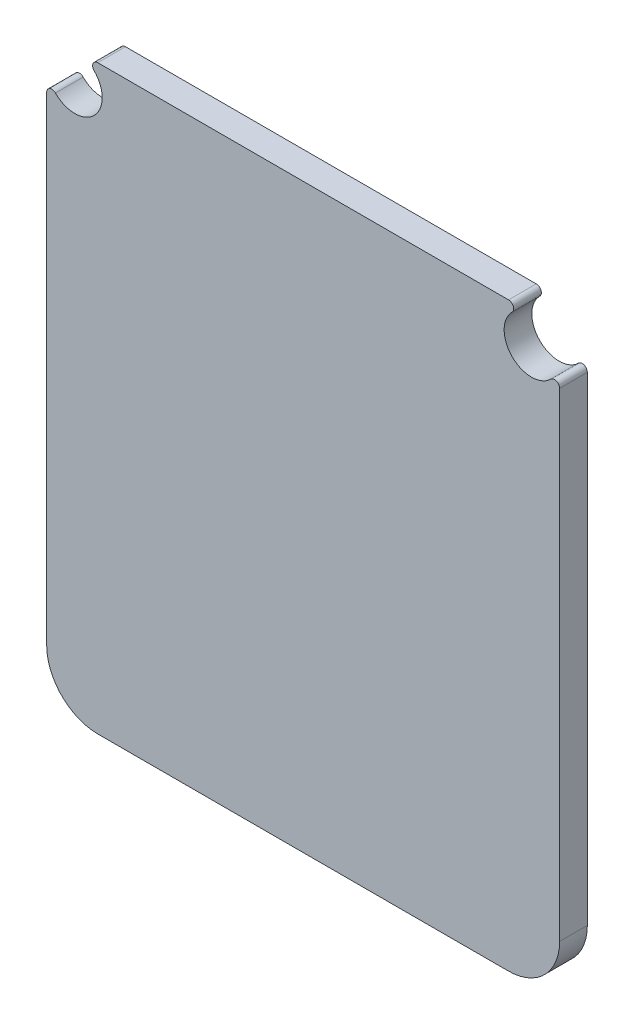
ISO-10303-21;
HEADER;
FILE_DESCRIPTION(('STEP AP214'),'2;1');
FILE_NAME('part.step','',(''),(''),'','','');
FILE_SCHEMA(('AUTOMOTIVE_DESIGN { 1 0 10303 214 1 1 1 1 }'));
ENDSEC;
DATA;
#1=APPLICATION_CONTEXT('core data for automotive mechanical design processes');
#2=APPLICATION_PROTOCOL_DEFINITION('international standard','automotive_design',2000,#1);
#3=PRODUCT_CONTEXT('',#1,'mechanical');
#4=PRODUCT('Part','Part','',(#3));
#5=PRODUCT_RELATED_PRODUCT_CATEGORY('part','',(#4));
#6=PRODUCT_DEFINITION_FORMATION('','',#4);
#7=PRODUCT_DEFINITION_CONTEXT('part definition',#1,'design');
#8=PRODUCT_DEFINITION('design','',#6,#7);
#9=PRODUCT_DEFINITION_SHAPE('','',#8);
#10=(LENGTH_UNIT() NAMED_UNIT(*) SI_UNIT(.MILLI.,.METRE.));
#11=(NAMED_UNIT(*) PLANE_ANGLE_UNIT() SI_UNIT($,.RADIAN.));
#12=(NAMED_UNIT(*) SI_UNIT($,.STERADIAN.) SOLID_ANGLE_UNIT());
#13=UNCERTAINTY_MEASURE_WITH_UNIT(LENGTH_MEASURE(1.E-05),#10,'distance_accuracy_value','');
#14=(GEOMETRIC_REPRESENTATION_CONTEXT(3) GLOBAL_UNCERTAINTY_ASSIGNED_CONTEXT((#13)) GLOBAL_UNIT_ASSIGNED_CONTEXT((#10,
#11,#12)) REPRESENTATION_CONTEXT('',''));
#15=CARTESIAN_POINT('',(0.,0.,0.));
#16=DIRECTION('',(0.,0.,1.));
#17=DIRECTION('',(1.,0.,0.));
#18=AXIS2_PLACEMENT_3D('',#15,#16,#17);
#19=CARTESIAN_POINT('',(13.,29.,1.6194));
#20=DIRECTION('',(0.,0.,-1.));
#21=DIRECTION('',(-1.,0.,0.));
#22=AXIS2_PLACEMENT_3D('',#19,#20,#21);
#23=CYLINDRICAL_SURFACE('',#22,3.);
#24=CARTESIAN_POINT('',(13.,29.,0.));
#25=DIRECTION('',(0.,0.,1.));
#26=DIRECTION('',(-1.,0.,0.));
#27=AXIS2_PLACEMENT_3D('',#24,#25,#26);
#28=CIRCLE('',#27,3.);
#29=CARTESIAN_POINT('',(10.,29.,0.));
#30=VERTEX_POINT('',#29);
#31=CARTESIAN_POINT('',(13.,26.,0.));
#32=VERTEX_POINT('',#31);
#33=EDGE_CURVE('E158',#30,#32,#28,.T.);
#34=ORIENTED_EDGE('',*,*,#33,.T.);
#35=DIRECTION('',(0.,0.,-1.));
#36=VECTOR('',#35,1.);
#37=CARTESIAN_POINT('',(13.,26.,1.6194));
#38=LINE('',#37,#36);
#39=CARTESIAN_POINT('',(13.,26.,1.6194));
#40=VERTEX_POINT('',#39);
#41=EDGE_CURVE('E11',#40,#32,#38,.T.);
#42=ORIENTED_EDGE('',*,*,#41,.F.);
#43=CARTESIAN_POINT('',(13.,29.,1.6194));
#44=DIRECTION('',(0.,0.,1.));
#45=DIRECTION('',(-1.,0.,0.));
#46=AXIS2_PLACEMENT_3D('',#43,#44,#45);
#47=CIRCLE('',#46,3.);
#48=CARTESIAN_POINT('',(10.,29.,1.6194));
#49=VERTEX_POINT('',#48);
#50=EDGE_CURVE('E180',#49,#40,#47,.T.);
#51=ORIENTED_EDGE('',*,*,#50,.F.);
#52=DIRECTION('',(0.,0.,-1.));
#53=VECTOR('',#52,1.);
#54=CARTESIAN_POINT('',(10.,29.,1.6194));
#55=LINE('',#54,#53);
#56=EDGE_CURVE('E154',#49,#30,#55,.T.);
#57=ORIENTED_EDGE('',*,*,#56,.T.);
#58=EDGE_LOOP('',(#34,#42,#51,#57));
#59=FACE_BOUND('',#58,.T.);
#60=ADVANCED_FACE('F38',(#59),#23,.T.);
#61=CARTESIAN_POINT('',(37.,26.,1.6194));
#62=DIRECTION('',(0.,1.,0.));
#63=DIRECTION('',(0.,0.,1.));
#64=AXIS2_PLACEMENT_3D('',#61,#62,#63);
#65=PLANE('',#64);
#66=DIRECTION('',(1.,0.,0.));
#67=VECTOR('',#66,1.);
#68=CARTESIAN_POINT('',(37.,26.,0.));
#69=LINE('',#68,#67);
#70=CARTESIAN_POINT('',(37.,26.,0.));
#71=VERTEX_POINT('',#70);
#72=EDGE_CURVE('E161',#32,#71,#69,.T.);
#73=ORIENTED_EDGE('',*,*,#72,.T.);
#74=DIRECTION('',(0.,0.,-1.));
#75=VECTOR('',#74,1.);
#76=CARTESIAN_POINT('',(37.,26.,1.6194));
#77=LINE('',#76,#75);
#78=CARTESIAN_POINT('',(37.,26.,1.6194));
#79=VERTEX_POINT('',#78);
#80=EDGE_CURVE('E46',#79,#71,#77,.T.);
#81=ORIENTED_EDGE('',*,*,#80,.F.);
#82=DIRECTION('',(1.,0.,0.));
#83=VECTOR('',#82,1.);
#84=CARTESIAN_POINT('',(37.,26.,1.6194));
#85=LINE('',#84,#83);
#86=EDGE_CURVE('E109',#40,#79,#85,.T.);
#87=ORIENTED_EDGE('',*,*,#86,.F.);
#88=ORIENTED_EDGE('',*,*,#41,.T.);
#89=EDGE_LOOP('',(#73,#81,#87,#88));
#90=FACE_BOUND('',#89,.T.);
#91=ADVANCED_FACE('F258',(#90),#65,.F.);
#92=CARTESIAN_POINT('',(37.0000100000167,28.9999899999833,1.6194));
#93=DIRECTION('',(0.,0.,-1.));
#94=DIRECTION('',(-1.,0.,0.));
#95=AXIS2_PLACEMENT_3D('',#92,#93,#94);
#96=CYLINDRICAL_SURFACE('',#95,2.99999);
#97=CARTESIAN_POINT('',(37.0000100000167,28.9999899999833,0.));
#98=DIRECTION('',(0.,0.,1.));
#99=DIRECTION('',(-1.,0.,0.));
#100=AXIS2_PLACEMENT_3D('',#97,#98,#99);
#101=CIRCLE('',#100,2.99999);
#102=CARTESIAN_POINT('',(40.,29.,0.));
#103=VERTEX_POINT('',#102);
#104=EDGE_CURVE('E163',#71,#103,#101,.T.);
#105=ORIENTED_EDGE('',*,*,#104,.T.);
#106=DIRECTION('',(0.,0.,-1.));
#107=VECTOR('',#106,1.);
#108=CARTESIAN_POINT('',(40.,29.,1.6194));
#109=LINE('',#108,#107);
#110=CARTESIAN_POINT('',(40.,29.,1.6194));
#111=VERTEX_POINT('',#110);
#112=EDGE_CURVE('E199',#111,#103,#109,.T.);
#113=ORIENTED_EDGE('',*,*,#112,.F.);
#114=CARTESIAN_POINT('',(37.0000100000167,28.9999899999833,1.6194));
#115=DIRECTION('',(0.,0.,1.));
#116=DIRECTION('',(-1.,0.,0.));
#117=AXIS2_PLACEMENT_3D('',#114,#115,#116);
#118=CIRCLE('',#117,2.99999);
#119=EDGE_CURVE('E207',#79,#111,#118,.T.);
#120=ORIENTED_EDGE('',*,*,#119,.F.);
#121=ORIENTED_EDGE('',*,*,#80,.T.);
#122=EDGE_LOOP('',(#105,#113,#120,#121));
#123=FACE_BOUND('',#122,.T.);
#124=ADVANCED_FACE('F205',(#123),#96,.T.);
#125=CARTESIAN_POINT('',(40.,57.01299,1.6194));
#126=DIRECTION('',(-1.,0.,0.));
#127=DIRECTION('',(0.,0.,1.));
#128=AXIS2_PLACEMENT_3D('',#125,#126,#127);
#129=PLANE('',#128);
#130=DIRECTION('',(0.,1.,0.));
#131=VECTOR('',#130,1.);
#132=CARTESIAN_POINT('',(40.,57.01299,0.));
#133=LINE('',#132,#131);
#134=CARTESIAN_POINT('',(40.,57.01299,0.));
#135=VERTEX_POINT('',#134);
#136=EDGE_CURVE('E165',#103,#135,#133,.T.);
#137=ORIENTED_EDGE('',*,*,#136,.T.);
#138=DIRECTION('',(0.,0.,-1.));
#139=VECTOR('',#138,1.);
#140=CARTESIAN_POINT('',(40.,57.01299,1.6194));
#141=LINE('',#140,#139);
#142=CARTESIAN_POINT('',(40.,57.01299,1.6194));
#143=VERTEX_POINT('',#142);
#144=EDGE_CURVE('E196',#143,#135,#141,.T.);
#145=ORIENTED_EDGE('',*,*,#144,.F.);
#146=DIRECTION('',(0.,1.,0.));
#147=VECTOR('',#146,1.);
#148=CARTESIAN_POINT('',(40.,57.01299,1.6194));
#149=LINE('',#148,#147);
#150=EDGE_CURVE('E225',#111,#143,#149,.T.);
#151=ORIENTED_EDGE('',*,*,#150,.F.);
#152=ORIENTED_EDGE('',*,*,#112,.T.);
#153=EDGE_LOOP('',(#137,#145,#151,#152));
#154=FACE_BOUND('',#153,.T.);
#155=ADVANCED_FACE('F216',(#154),#129,.F.);
#156=CARTESIAN_POINT('',(39.700000000423,57.0130059320103,1.6194));
#157=DIRECTION('',(0.,0.,-1.));
#158=DIRECTION('',(-1.,0.,0.));
#159=AXIS2_PLACEMENT_3D('',#156,#157,#158);
#160=CYLINDRICAL_SURFACE('',#159,0.300000000000002);
#161=CARTESIAN_POINT('',(39.700000000423,57.0130059320103,0.));
#162=DIRECTION('',(0.,0.,1.));
#163=DIRECTION('',(-1.,0.,0.));
#164=AXIS2_PLACEMENT_3D('',#161,#162,#163);
#165=CIRCLE('',#164,0.300000000000002);
#166=CARTESIAN_POINT('',(39.48786,57.22513,0.));
#167=VERTEX_POINT('',#166);
#168=EDGE_CURVE('E167',#135,#167,#165,.T.);
#169=ORIENTED_EDGE('',*,*,#168,.T.);
#170=DIRECTION('',(0.,0.,-1.));
#171=VECTOR('',#170,1.);
#172=CARTESIAN_POINT('',(39.48786,57.22513,1.6194));
#173=LINE('',#172,#171);
#174=CARTESIAN_POINT('',(39.48786,57.22513,1.6194));
#175=VERTEX_POINT('',#174);
#176=EDGE_CURVE('E193',#175,#167,#173,.T.);
#177=ORIENTED_EDGE('',*,*,#176,.F.);
#178=CARTESIAN_POINT('',(39.700000000423,57.0130059320103,1.6194));
#179=DIRECTION('',(0.,0.,1.));
#180=DIRECTION('',(-1.,0.,0.));
#181=AXIS2_PLACEMENT_3D('',#178,#179,#180);
#182=CIRCLE('',#181,0.300000000000002);
#183=EDGE_CURVE('E222',#143,#175,#182,.T.);
#184=ORIENTED_EDGE('',*,*,#183,.F.);
#185=ORIENTED_EDGE('',*,*,#144,.T.);
#186=EDGE_LOOP('',(#169,#177,#184,#185));
#187=FACE_BOUND('',#186,.T.);
#188=ADVANCED_FACE('F220',(#187),#160,.T.);
#189=CARTESIAN_POINT('',(38.35510324119,58.35511324119,1.6194));
#190=DIRECTION('',(0.,0.,-1.));
#191=DIRECTION('',(-1.,0.,0.));
#192=AXIS2_PLACEMENT_3D('',#189,#190,#191);
#193=CYLINDRICAL_SURFACE('',#192,1.6);
#194=CARTESIAN_POINT('',(38.35510324119,58.35511324119,0.));
#195=DIRECTION('',(0.,0.,-1.));
#196=DIRECTION('',(1.,0.,0.));
#197=AXIS2_PLACEMENT_3D('',#194,#195,#196);
#198=CIRCLE('',#197,1.6);
#199=CARTESIAN_POINT('',(37.22512,59.48787,0.));
#200=VERTEX_POINT('',#199);
#201=EDGE_CURVE('E169',#167,#200,#198,.T.);
#202=ORIENTED_EDGE('',*,*,#201,.T.);
#203=DIRECTION('',(0.,0.,-1.));
#204=VECTOR('',#203,1.);
#205=CARTESIAN_POINT('',(37.22512,59.48787,1.6194));
#206=LINE('',#205,#204);
#207=CARTESIAN_POINT('',(37.22512,59.48787,1.6194));
#208=VERTEX_POINT('',#207);
#209=EDGE_CURVE('E190',#208,#200,#206,.T.);
#210=ORIENTED_EDGE('',*,*,#209,.F.);
#211=CARTESIAN_POINT('',(38.35510324119,58.35511324119,1.6194));
#212=DIRECTION('',(0.,0.,-1.));
#213=DIRECTION('',(1.,0.,0.));
#214=AXIS2_PLACEMENT_3D('',#211,#212,#213);
#215=CIRCLE('',#214,1.6);
#216=EDGE_CURVE('E224',#175,#208,#215,.T.);
#217=ORIENTED_EDGE('',*,*,#216,.F.);
#218=ORIENTED_EDGE('',*,*,#176,.T.);
#219=EDGE_LOOP('',(#202,#210,#217,#218));
#220=FACE_BOUND('',#219,.T.);
#221=ADVANCED_FACE('F271',(#220),#193,.F.);
#222=CARTESIAN_POINT('',(37.0129859313352,59.7000000000276,1.6194));
#223=DIRECTION('',(0.,0.,-1.));
#224=DIRECTION('',(-1.,0.,0.));
#225=AXIS2_PLACEMENT_3D('',#222,#223,#224);
#226=CYLINDRICAL_SURFACE('',#225,0.300000000000002);
#227=CARTESIAN_POINT('',(37.0129859313352,59.7000000000276,0.));
#228=DIRECTION('',(0.,0.,1.));
#229=DIRECTION('',(-1.,0.,0.));
#230=AXIS2_PLACEMENT_3D('',#227,#228,#229);
#231=CIRCLE('',#230,0.300000000000002);
#232=CARTESIAN_POINT('',(37.01299,60.,0.));
#233=VERTEX_POINT('',#232);
#234=EDGE_CURVE('E171',#200,#233,#231,.T.);
#235=ORIENTED_EDGE('',*,*,#234,.T.);
#236=DIRECTION('',(0.,0.,-1.));
#237=VECTOR('',#236,1.);
#238=CARTESIAN_POINT('',(37.01299,60.,1.6194));
#239=LINE('',#238,#237);
#240=CARTESIAN_POINT('',(37.01299,60.,1.6194));
#241=VERTEX_POINT('',#240);
#242=EDGE_CURVE('E187',#241,#233,#239,.T.);
#243=ORIENTED_EDGE('',*,*,#242,.F.);
#244=CARTESIAN_POINT('',(37.0129859313352,59.7000000000276,1.6194));
#245=DIRECTION('',(0.,0.,1.));
#246=DIRECTION('',(-1.,0.,0.));
#247=AXIS2_PLACEMENT_3D('',#244,#245,#246);
#248=CIRCLE('',#247,0.300000000000002);
#249=EDGE_CURVE('E227',#208,#241,#248,.T.);
#250=ORIENTED_EDGE('',*,*,#249,.F.);
#251=ORIENTED_EDGE('',*,*,#209,.T.);
#252=EDGE_LOOP('',(#235,#243,#250,#251));
#253=FACE_BOUND('',#252,.T.);
#254=ADVANCED_FACE('F274',(#253),#226,.T.);
#255=CARTESIAN_POINT('',(12.987,60.,1.6194));
#256=DIRECTION('',(0.,-1.,0.));
#257=DIRECTION('',(0.,0.,-1.));
#258=AXIS2_PLACEMENT_3D('',#255,#256,#257);
#259=PLANE('',#258);
#260=DIRECTION('',(-1.,0.,0.));
#261=VECTOR('',#260,1.);
#262=CARTESIAN_POINT('',(12.987,60.,0.));
#263=LINE('',#262,#261);
#264=CARTESIAN_POINT('',(12.987,60.,0.));
#265=VERTEX_POINT('',#264);
#266=EDGE_CURVE('E173',#233,#265,#263,.T.);
#267=ORIENTED_EDGE('',*,*,#266,.T.);
#268=DIRECTION('',(0.,0.,-1.));
#269=VECTOR('',#268,1.);
#270=CARTESIAN_POINT('',(12.987,60.,1.6194));
#271=LINE('',#270,#269);
#272=CARTESIAN_POINT('',(12.987,60.,1.6194));
#273=VERTEX_POINT('',#272);
#274=EDGE_CURVE('E184',#273,#265,#271,.T.);
#275=ORIENTED_EDGE('',*,*,#274,.F.);
#276=DIRECTION('',(-1.,0.,0.));
#277=VECTOR('',#276,1.);
#278=CARTESIAN_POINT('',(12.987,60.,1.6194));
#279=LINE('',#278,#277);
#280=EDGE_CURVE('E233',#241,#273,#279,.T.);
#281=ORIENTED_EDGE('',*,*,#280,.F.);
#282=ORIENTED_EDGE('',*,*,#242,.T.);
#283=EDGE_LOOP('',(#267,#275,#281,#282));
#284=FACE_BOUND('',#283,.T.);
#285=ADVANCED_FACE('F239',(#284),#259,.F.);
#286=CARTESIAN_POINT('',(12.9869940683542,59.7000000000586,1.6194));
#287=DIRECTION('',(0.,0.,-1.));
#288=DIRECTION('',(-1.,0.,0.));
#289=AXIS2_PLACEMENT_3D('',#286,#287,#288);
#290=CYLINDRICAL_SURFACE('',#289,0.299999999999999);
#291=CARTESIAN_POINT('',(12.9869940683542,59.7000000000586,0.));
#292=DIRECTION('',(0.,0.,1.));
#293=DIRECTION('',(-1.,0.,0.));
#294=AXIS2_PLACEMENT_3D('',#291,#292,#293);
#295=CIRCLE('',#294,0.299999999999999);
#296=CARTESIAN_POINT('',(12.77487,59.48786,0.));
#297=VERTEX_POINT('',#296);
#298=EDGE_CURVE('E175',#265,#297,#295,.T.);
#299=ORIENTED_EDGE('',*,*,#298,.T.);
#300=DIRECTION('',(0.,0.,-1.));
#301=VECTOR('',#300,1.);
#302=CARTESIAN_POINT('',(12.77487,59.48786,1.6194));
#303=LINE('',#302,#301);
#304=CARTESIAN_POINT('',(12.77487,59.48786,1.6194));
#305=VERTEX_POINT('',#304);
#306=EDGE_CURVE('E149',#305,#297,#303,.T.);
#307=ORIENTED_EDGE('',*,*,#306,.F.);
#308=CARTESIAN_POINT('',(12.9869940683542,59.7000000000586,1.6194));
#309=DIRECTION('',(0.,0.,1.));
#310=DIRECTION('',(-1.,0.,0.));
#311=AXIS2_PLACEMENT_3D('',#308,#309,#310);
#312=CIRCLE('',#311,0.299999999999999);
#313=EDGE_CURVE('E140',#273,#305,#312,.T.);
#314=ORIENTED_EDGE('',*,*,#313,.F.);
#315=ORIENTED_EDGE('',*,*,#274,.T.);
#316=EDGE_LOOP('',(#299,#307,#314,#315));
#317=FACE_BOUND('',#316,.T.);
#318=ADVANCED_FACE('F243',(#317),#290,.T.);
#319=CARTESIAN_POINT('',(11.6462531625457,58.3537418252868,1.6194));
#320=DIRECTION('',(0.,0.,-1.));
#321=DIRECTION('',(-1.,0.,0.));
#322=AXIS2_PLACEMENT_3D('',#319,#320,#321);
#323=CYLINDRICAL_SURFACE('',#322,1.6);
#324=CARTESIAN_POINT('',(11.6462531625457,58.3537418252868,0.));
#325=DIRECTION('',(0.,0.,-1.));
#326=DIRECTION('',(1.,0.,0.));
#327=AXIS2_PLACEMENT_3D('',#324,#325,#326);
#328=CIRCLE('',#327,1.6);
#329=CARTESIAN_POINT('',(10.51213,57.22513,0.));
#330=VERTEX_POINT('',#329);
#331=EDGE_CURVE('E148',#297,#330,#328,.T.);
#332=ORIENTED_EDGE('',*,*,#331,.T.);
#333=DIRECTION('',(0.,0.,-1.));
#334=VECTOR('',#333,1.);
#335=CARTESIAN_POINT('',(10.51213,57.22513,1.6194));
#336=LINE('',#335,#334);
#337=CARTESIAN_POINT('',(10.51213,57.22513,1.6194));
#338=VERTEX_POINT('',#337);
#339=EDGE_CURVE('E145',#338,#330,#336,.T.);
#340=ORIENTED_EDGE('',*,*,#339,.F.);
#341=CARTESIAN_POINT('',(11.6462531625457,58.3537418252868,1.6194));
#342=DIRECTION('',(0.,0.,-1.));
#343=DIRECTION('',(1.,0.,0.));
#344=AXIS2_PLACEMENT_3D('',#341,#342,#343);
#345=CIRCLE('',#344,1.6);
#346=EDGE_CURVE('E134',#305,#338,#345,.T.);
#347=ORIENTED_EDGE('',*,*,#346,.F.);
#348=ORIENTED_EDGE('',*,*,#306,.T.);
#349=EDGE_LOOP('',(#332,#340,#347,#348));
#350=FACE_BOUND('',#349,.T.);
#351=ADVANCED_FACE('F146',(#350),#323,.F.);
#352=CARTESIAN_POINT('',(10.2999999999414,57.0129959313662,1.6194));
#353=DIRECTION('',(0.,0.,-1.));
#354=DIRECTION('',(-1.,0.,0.));
#355=AXIS2_PLACEMENT_3D('',#352,#353,#354);
#356=CYLINDRICAL_SURFACE('',#355,0.300000000000002);
#357=CARTESIAN_POINT('',(10.2999999999414,57.0129959313662,0.));
#358=DIRECTION('',(0.,0.,1.));
#359=DIRECTION('',(-1.,0.,0.));
#360=AXIS2_PLACEMENT_3D('',#357,#358,#359);
#361=CIRCLE('',#360,0.300000000000002);
#362=CARTESIAN_POINT('',(10.,57.01299,0.));
#363=VERTEX_POINT('',#362);
#364=EDGE_CURVE('E95',#330,#363,#361,.T.);
#365=ORIENTED_EDGE('',*,*,#364,.T.);
#366=DIRECTION('',(0.,0.,-1.));
#367=VECTOR('',#366,1.);
#368=CARTESIAN_POINT('',(10.,57.01299,1.6194));
#369=LINE('',#368,#367);
#370=CARTESIAN_POINT('',(10.,57.01299,1.6194));
#371=VERTEX_POINT('',#370);
#372=EDGE_CURVE('E150',#371,#363,#369,.T.);
#373=ORIENTED_EDGE('',*,*,#372,.F.);
#374=CARTESIAN_POINT('',(10.2999999999414,57.0129959313662,1.6194));
#375=DIRECTION('',(0.,0.,1.));
#376=DIRECTION('',(-1.,0.,0.));
#377=AXIS2_PLACEMENT_3D('',#374,#375,#376);
#378=CIRCLE('',#377,0.300000000000002);
#379=EDGE_CURVE('E138',#338,#371,#378,.T.);
#380=ORIENTED_EDGE('',*,*,#379,.F.);
#381=ORIENTED_EDGE('',*,*,#339,.T.);
#382=EDGE_LOOP('',(#365,#373,#380,#381));
#383=FACE_BOUND('',#382,.T.);
#384=ADVANCED_FACE('F152',(#383),#356,.T.);
#385=CARTESIAN_POINT('',(10.,29.,1.6194));
#386=DIRECTION('',(1.,0.,0.));
#387=DIRECTION('',(0.,0.,-1.));
#388=AXIS2_PLACEMENT_3D('',#385,#386,#387);
#389=PLANE('',#388);
#390=DIRECTION('',(0.,-1.,0.));
#391=VECTOR('',#390,1.);
#392=CARTESIAN_POINT('',(10.,29.,0.));
#393=LINE('',#392,#391);
#394=EDGE_CURVE('E101',#363,#30,#393,.T.);
#395=ORIENTED_EDGE('',*,*,#394,.T.);
#396=ORIENTED_EDGE('',*,*,#56,.F.);
#397=DIRECTION('',(0.,-1.,0.));
#398=VECTOR('',#397,1.);
#399=CARTESIAN_POINT('',(10.,29.,1.6194));
#400=LINE('',#399,#398);
#401=EDGE_CURVE('E54',#371,#49,#400,.T.);
#402=ORIENTED_EDGE('',*,*,#401,.F.);
#403=ORIENTED_EDGE('',*,*,#372,.T.);
#404=EDGE_LOOP('',(#395,#396,#402,#403));
#405=FACE_BOUND('',#404,.T.);
#406=ADVANCED_FACE('F247',(#405),#389,.F.);
#407=CARTESIAN_POINT('',(13.,29.,1.6194));
#408=DIRECTION('',(0.,0.,-1.));
#409=DIRECTION('',(-1.,0.,0.));
#410=AXIS2_PLACEMENT_3D('',#407,#408,#409);
#411=PLANE('',#410);
#412=ORIENTED_EDGE('',*,*,#50,.T.);
#413=ORIENTED_EDGE('',*,*,#86,.T.);
#414=ORIENTED_EDGE('',*,*,#119,.T.);
#415=ORIENTED_EDGE('',*,*,#150,.T.);
#416=ORIENTED_EDGE('',*,*,#183,.T.);
#417=ORIENTED_EDGE('',*,*,#216,.T.);
#418=ORIENTED_EDGE('',*,*,#249,.T.);
#419=ORIENTED_EDGE('',*,*,#280,.T.);
#420=ORIENTED_EDGE('',*,*,#313,.T.);
#421=ORIENTED_EDGE('',*,*,#346,.T.);
#422=ORIENTED_EDGE('',*,*,#379,.T.);
#423=ORIENTED_EDGE('',*,*,#401,.T.);
#424=EDGE_LOOP('',(#412,#413,#414,#415,#416,#417,#418,#419,#420,#421,#422,#423));
#425=FACE_BOUND('',#424,.T.);
#426=ADVANCED_FACE('F136',(#425),#411,.F.);
#427=CARTESIAN_POINT('',(13.,29.,0.));
#428=DIRECTION('',(0.,0.,-1.));
#429=DIRECTION('',(-1.,0.,0.));
#430=AXIS2_PLACEMENT_3D('',#427,#428,#429);
#431=PLANE('',#430);
#432=ORIENTED_EDGE('',*,*,#33,.F.);
#433=ORIENTED_EDGE('',*,*,#394,.F.);
#434=ORIENTED_EDGE('',*,*,#364,.F.);
#435=ORIENTED_EDGE('',*,*,#331,.F.);
#436=ORIENTED_EDGE('',*,*,#298,.F.);
#437=ORIENTED_EDGE('',*,*,#266,.F.);
#438=ORIENTED_EDGE('',*,*,#234,.F.);
#439=ORIENTED_EDGE('',*,*,#201,.F.);
#440=ORIENTED_EDGE('',*,*,#168,.F.);
#441=ORIENTED_EDGE('',*,*,#136,.F.);
#442=ORIENTED_EDGE('',*,*,#104,.F.);
#443=ORIENTED_EDGE('',*,*,#72,.F.);
#444=EDGE_LOOP('',(#432,#433,#434,#435,#436,#437,#438,#439,#440,#441,#442,#443));
#445=FACE_BOUND('',#444,.T.);
#446=ADVANCED_FACE('F211',(#445),#431,.T.);
#447=CLOSED_SHELL('',(#60,#91,#124,#155,#188,#221,#254,#285,#318,#351,#384,#406,#426,#446));
#448=MANIFOLD_SOLID_BREP('B2',#447);
#449=ADVANCED_BREP_SHAPE_REPRESENTATION('',(#18,#448),#14);
#450=SHAPE_DEFINITION_REPRESENTATION(#9,#449);
ENDSEC;
END-ISO-10303-21;
